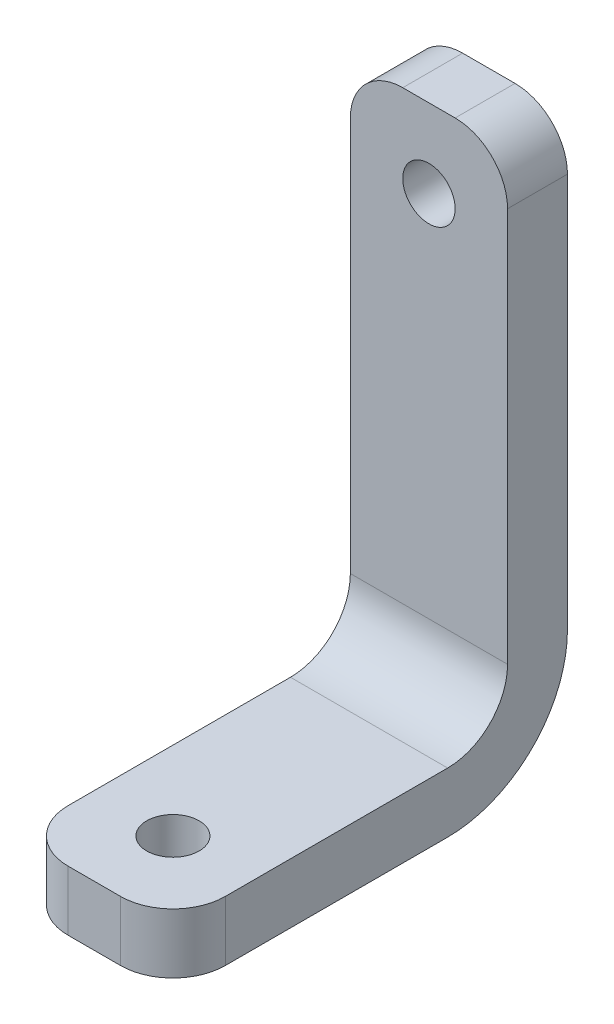
ISO-10303-21;
HEADER;
FILE_DESCRIPTION(('STEP AP214'),'2;1');
FILE_NAME('part.step','',(''),(''),'','','');
FILE_SCHEMA(('AUTOMOTIVE_DESIGN { 1 0 10303 214 1 1 1 1 }'));
ENDSEC;
DATA;
#1=APPLICATION_CONTEXT('core data for automotive mechanical design processes');
#2=APPLICATION_PROTOCOL_DEFINITION('international standard','automotive_design',2000,#1);
#3=PRODUCT_CONTEXT('',#1,'mechanical');
#4=PRODUCT('Part','Part','',(#3));
#5=PRODUCT_RELATED_PRODUCT_CATEGORY('part','',(#4));
#6=PRODUCT_DEFINITION_FORMATION('','',#4);
#7=PRODUCT_DEFINITION_CONTEXT('part definition',#1,'design');
#8=PRODUCT_DEFINITION('design','',#6,#7);
#9=PRODUCT_DEFINITION_SHAPE('','',#8);
#10=(LENGTH_UNIT() NAMED_UNIT(*) SI_UNIT(.MILLI.,.METRE.));
#11=(NAMED_UNIT(*) PLANE_ANGLE_UNIT() SI_UNIT($,.RADIAN.));
#12=(NAMED_UNIT(*) SI_UNIT($,.STERADIAN.) SOLID_ANGLE_UNIT());
#13=UNCERTAINTY_MEASURE_WITH_UNIT(LENGTH_MEASURE(1.E-05),#10,'distance_accuracy_value','');
#14=(GEOMETRIC_REPRESENTATION_CONTEXT(3) GLOBAL_UNCERTAINTY_ASSIGNED_CONTEXT((#13)) GLOBAL_UNIT_ASSIGNED_CONTEXT((#10,
#11,#12)) REPRESENTATION_CONTEXT('',''));
#15=CARTESIAN_POINT('',(0.,0.,0.));
#16=DIRECTION('',(0.,0.,1.));
#17=DIRECTION('',(1.,0.,0.));
#18=AXIS2_PLACEMENT_3D('',#15,#16,#17);
#19=CARTESIAN_POINT('',(0.,0.,4.));
#20=DIRECTION('',(0.,0.,1.));
#21=DIRECTION('',(1.,0.,0.));
#22=AXIS2_PLACEMENT_3D('',#19,#20,#21);
#23=PLANE('',#22);
#24=DIRECTION('',(0.,-1.,0.));
#25=VECTOR('',#24,1.);
#26=CARTESIAN_POINT('',(-5.24999999999999,18.925,4.));
#27=LINE('',#26,#25);
#28=CARTESIAN_POINT('',(-5.24999999999999,15.425,4.));
#29=VERTEX_POINT('',#28);
#30=CARTESIAN_POINT('',(-5.24999999999999,-10.925,4.));
#31=VERTEX_POINT('',#30);
#32=EDGE_CURVE('E188',#29,#31,#27,.T.);
#33=ORIENTED_EDGE('',*,*,#32,.T.);
#34=DIRECTION('',(-1.,0.,0.));
#35=VECTOR('',#34,1.);
#36=CARTESIAN_POINT('',(0.,-10.925,4.));
#37=LINE('',#36,#35);
#38=CARTESIAN_POINT('',(5.24999999999999,-10.925,4.));
#39=VERTEX_POINT('',#38);
#40=EDGE_CURVE('E260',#31,#39,#37,.F.);
#41=ORIENTED_EDGE('',*,*,#40,.T.);
#42=DIRECTION('',(0.,1.,0.));
#43=VECTOR('',#42,1.);
#44=CARTESIAN_POINT('',(5.24999999999999,18.925,4.));
#45=LINE('',#44,#43);
#46=CARTESIAN_POINT('',(5.24999999999999,15.425,4.));
#47=VERTEX_POINT('',#46);
#48=EDGE_CURVE('E192',#39,#47,#45,.T.);
#49=ORIENTED_EDGE('',*,*,#48,.T.);
#50=CARTESIAN_POINT('',(1.74999999999999,15.425,4.));
#51=DIRECTION('',(0.,0.,1.));
#52=DIRECTION('',(1.,0.,0.));
#53=AXIS2_PLACEMENT_3D('',#50,#51,#52);
#54=CIRCLE('',#53,3.5);
#55=CARTESIAN_POINT('',(1.74999999999999,18.925,4.));
#56=VERTEX_POINT('',#55);
#57=EDGE_CURVE('E250',#47,#56,#54,.T.);
#58=ORIENTED_EDGE('',*,*,#57,.T.);
#59=DIRECTION('',(-1.,0.,0.));
#60=VECTOR('',#59,1.);
#61=CARTESIAN_POINT('',(-5.24999999999999,18.925,4.));
#62=LINE('',#61,#60);
#63=CARTESIAN_POINT('',(-1.74999999999999,18.925,4.));
#64=VERTEX_POINT('',#63);
#65=EDGE_CURVE('E196',#56,#64,#62,.T.);
#66=ORIENTED_EDGE('',*,*,#65,.T.);
#67=CARTESIAN_POINT('',(-1.74999999999999,15.425,4.));
#68=DIRECTION('',(0.,0.,1.));
#69=DIRECTION('',(1.,0.,0.));
#70=AXIS2_PLACEMENT_3D('',#67,#68,#69);
#71=CIRCLE('',#70,3.5);
#72=EDGE_CURVE('E253',#64,#29,#71,.T.);
#73=ORIENTED_EDGE('',*,*,#72,.T.);
#74=EDGE_LOOP('',(#33,#41,#49,#58,#66,#73));
#75=FACE_BOUND('',#74,.T.);
#76=CARTESIAN_POINT('',(0.,13.675,4.));
#77=DIRECTION('',(0.,0.,1.));
#78=DIRECTION('',(1.,0.,0.));
#79=AXIS2_PLACEMENT_3D('',#76,#77,#78);
#80=CIRCLE('',#79,1.75);
#81=CARTESIAN_POINT('',(1.75,13.675,4.));
#82=VERTEX_POINT('',#81);
#83=EDGE_CURVE('E180',#82,#82,#80,.T.);
#84=ORIENTED_EDGE('',*,*,#83,.F.);
#85=EDGE_LOOP('',(#84));
#86=FACE_BOUND('',#85,.T.);
#87=ADVANCED_FACE('F42',(#75,#86),#23,.T.);
#88=CARTESIAN_POINT('',(0.,0.,0.));
#89=DIRECTION('',(0.,0.,1.));
#90=DIRECTION('',(1.,0.,0.));
#91=AXIS2_PLACEMENT_3D('',#88,#89,#90);
#92=PLANE('',#91);
#93=DIRECTION('',(0.,1.,0.));
#94=VECTOR('',#93,1.);
#95=CARTESIAN_POINT('',(5.24999999999999,18.925,0.));
#96=LINE('',#95,#94);
#97=CARTESIAN_POINT('',(5.24999999999999,-10.925,0.));
#98=VERTEX_POINT('',#97);
#99=CARTESIAN_POINT('',(5.24999999999999,15.425,0.));
#100=VERTEX_POINT('',#99);
#101=EDGE_CURVE('E203',#98,#100,#96,.T.);
#102=ORIENTED_EDGE('',*,*,#101,.F.);
#103=DIRECTION('',(1.,0.,0.));
#104=VECTOR('',#103,1.);
#105=CARTESIAN_POINT('',(0.,-10.925,0.));
#106=LINE('',#105,#104);
#107=CARTESIAN_POINT('',(-5.24999999999999,-10.925,0.));
#108=VERTEX_POINT('',#107);
#109=EDGE_CURVE('E51',#98,#108,#106,.F.);
#110=ORIENTED_EDGE('',*,*,#109,.T.);
#111=DIRECTION('',(0.,-1.,0.));
#112=VECTOR('',#111,1.);
#113=CARTESIAN_POINT('',(-5.24999999999999,18.925,0.));
#114=LINE('',#113,#112);
#115=CARTESIAN_POINT('',(-5.24999999999999,15.425,0.));
#116=VERTEX_POINT('',#115);
#117=EDGE_CURVE('E184',#116,#108,#114,.T.);
#118=ORIENTED_EDGE('',*,*,#117,.F.);
#119=CARTESIAN_POINT('',(-1.74999999999999,15.425,0.));
#120=DIRECTION('',(0.,0.,1.));
#121=DIRECTION('',(1.,0.,0.));
#122=AXIS2_PLACEMENT_3D('',#119,#120,#121);
#123=CIRCLE('',#122,3.5);
#124=CARTESIAN_POINT('',(-1.74999999999999,18.925,0.));
#125=VERTEX_POINT('',#124);
#126=EDGE_CURVE('E240',#116,#125,#123,.F.);
#127=ORIENTED_EDGE('',*,*,#126,.T.);
#128=DIRECTION('',(-1.,0.,0.));
#129=VECTOR('',#128,1.);
#130=CARTESIAN_POINT('',(-5.24999999999999,18.925,0.));
#131=LINE('',#130,#129);
#132=CARTESIAN_POINT('',(1.74999999999999,18.925,0.));
#133=VERTEX_POINT('',#132);
#134=EDGE_CURVE('E193',#133,#125,#131,.T.);
#135=ORIENTED_EDGE('',*,*,#134,.F.);
#136=CARTESIAN_POINT('',(1.74999999999999,15.425,0.));
#137=DIRECTION('',(0.,0.,1.));
#138=DIRECTION('',(1.,0.,0.));
#139=AXIS2_PLACEMENT_3D('',#136,#137,#138);
#140=CIRCLE('',#139,3.5);
#141=EDGE_CURVE('E236',#133,#100,#140,.F.);
#142=ORIENTED_EDGE('',*,*,#141,.T.);
#143=EDGE_LOOP('',(#102,#110,#118,#127,#135,#142));
#144=FACE_BOUND('',#143,.T.);
#145=CARTESIAN_POINT('',(0.,13.675,0.));
#146=DIRECTION('',(0.,0.,1.));
#147=DIRECTION('',(1.,0.,0.));
#148=AXIS2_PLACEMENT_3D('',#145,#146,#147);
#149=CIRCLE('',#148,1.75);
#150=CARTESIAN_POINT('',(1.75,13.675,0.));
#151=VERTEX_POINT('',#150);
#152=EDGE_CURVE('E179',#151,#151,#149,.T.);
#153=ORIENTED_EDGE('',*,*,#152,.T.);
#154=EDGE_LOOP('',(#153));
#155=FACE_BOUND('',#154,.T.);
#156=ADVANCED_FACE('F298',(#144,#155),#92,.F.);
#157=CARTESIAN_POINT('',(-5.24999999999999,18.925,4.));
#158=DIRECTION('',(1.,0.,0.));
#159=DIRECTION('',(0.,0.,-1.));
#160=AXIS2_PLACEMENT_3D('',#157,#158,#159);
#161=PLANE('',#160);
#162=ORIENTED_EDGE('',*,*,#117,.T.);
#163=CARTESIAN_POINT('',(-5.24999999999999,-10.925,8.));
#164=DIRECTION('',(1.,0.,0.));
#165=DIRECTION('',(0.,0.,-1.));
#166=AXIS2_PLACEMENT_3D('',#163,#164,#165);
#167=CIRCLE('',#166,8.);
#168=CARTESIAN_POINT('',(-5.24999999999999,-18.925,8.));
#169=VERTEX_POINT('',#168);
#170=EDGE_CURVE('E11',#108,#169,#167,.F.);
#171=ORIENTED_EDGE('',*,*,#170,.T.);
#172=DIRECTION('',(0.,0.,-1.));
#173=VECTOR('',#172,1.);
#174=CARTESIAN_POINT('',(-5.24999999999999,-18.925,4.));
#175=LINE('',#174,#173);
#176=CARTESIAN_POINT('',(-5.24999999999999,-18.925,22.85));
#177=VERTEX_POINT('',#176);
#178=EDGE_CURVE('E211',#177,#169,#175,.T.);
#179=ORIENTED_EDGE('',*,*,#178,.F.);
#180=DIRECTION('',(0.,-1.,0.));
#181=VECTOR('',#180,1.);
#182=CARTESIAN_POINT('',(-5.24999999999999,18.925,22.85));
#183=LINE('',#182,#181);
#184=CARTESIAN_POINT('',(-5.24999999999999,-14.925,22.85));
#185=VERTEX_POINT('',#184);
#186=EDGE_CURVE('E136',#177,#185,#183,.F.);
#187=ORIENTED_EDGE('',*,*,#186,.T.);
#188=DIRECTION('',(0.,0.,-1.));
#189=VECTOR('',#188,1.);
#190=CARTESIAN_POINT('',(-5.24999999999999,-14.925,26.35));
#191=LINE('',#190,#189);
#192=CARTESIAN_POINT('',(-5.24999999999999,-14.925,8.00000000000001));
#193=VERTEX_POINT('',#192);
#194=EDGE_CURVE('E165',#185,#193,#191,.T.);
#195=ORIENTED_EDGE('',*,*,#194,.T.);
#196=CARTESIAN_POINT('',(-5.24999999999999,-10.925,8.));
#197=DIRECTION('',(1.,0.,0.));
#198=DIRECTION('',(0.,0.,-1.));
#199=AXIS2_PLACEMENT_3D('',#196,#197,#198);
#200=CIRCLE('',#199,4.);
#201=EDGE_CURVE('E263',#193,#31,#200,.T.);
#202=ORIENTED_EDGE('',*,*,#201,.T.);
#203=ORIENTED_EDGE('',*,*,#32,.F.);
#204=DIRECTION('',(0.,0.,-1.));
#205=VECTOR('',#204,1.);
#206=CARTESIAN_POINT('',(-5.24999999999999,15.425,4.));
#207=LINE('',#206,#205);
#208=EDGE_CURVE('E142',#29,#116,#207,.T.);
#209=ORIENTED_EDGE('',*,*,#208,.T.);
#210=EDGE_LOOP('',(#162,#171,#179,#187,#195,#202,#203,#209));
#211=FACE_BOUND('',#210,.T.);
#212=ADVANCED_FACE('F288',(#211),#161,.F.);
#213=CARTESIAN_POINT('',(-5.24999999999999,-18.925,4.));
#214=DIRECTION('',(0.,1.,0.));
#215=DIRECTION('',(0.,0.,1.));
#216=AXIS2_PLACEMENT_3D('',#213,#214,#215);
#217=PLANE('',#216);
#218=CARTESIAN_POINT('',(0.,-18.925,21.1));
#219=DIRECTION('',(0.,-1.,0.));
#220=DIRECTION('',(0.,0.,-1.));
#221=AXIS2_PLACEMENT_3D('',#218,#219,#220);
#222=CIRCLE('',#221,1.75);
#223=CARTESIAN_POINT('',(0.,-18.925,19.35));
#224=VERTEX_POINT('',#223);
#225=EDGE_CURVE('E168',#224,#224,#222,.T.);
#226=ORIENTED_EDGE('',*,*,#225,.F.);
#227=EDGE_LOOP('',(#226));
#228=FACE_BOUND('',#227,.T.);
#229=ORIENTED_EDGE('',*,*,#178,.T.);
#230=DIRECTION('',(1.,0.,0.));
#231=VECTOR('',#230,1.);
#232=CARTESIAN_POINT('',(-5.24999999999999,-18.925,8.));
#233=LINE('',#232,#231);
#234=CARTESIAN_POINT('',(5.24999999999999,-18.925,8.));
#235=VERTEX_POINT('',#234);
#236=EDGE_CURVE('E269',#169,#235,#233,.T.);
#237=ORIENTED_EDGE('',*,*,#236,.T.);
#238=DIRECTION('',(0.,0.,-1.));
#239=VECTOR('',#238,1.);
#240=CARTESIAN_POINT('',(5.24999999999999,-18.925,4.));
#241=LINE('',#240,#239);
#242=CARTESIAN_POINT('',(5.24999999999999,-18.925,22.85));
#243=VERTEX_POINT('',#242);
#244=EDGE_CURVE('E200',#243,#235,#241,.T.);
#245=ORIENTED_EDGE('',*,*,#244,.F.);
#246=CARTESIAN_POINT('',(1.74999999999999,-18.925,22.85));
#247=DIRECTION('',(0.,1.,0.));
#248=DIRECTION('',(0.,0.,1.));
#249=AXIS2_PLACEMENT_3D('',#246,#247,#248);
#250=CIRCLE('',#249,3.5);
#251=CARTESIAN_POINT('',(1.74999999999999,-18.925,26.35));
#252=VERTEX_POINT('',#251);
#253=EDGE_CURVE('E143',#243,#252,#250,.F.);
#254=ORIENTED_EDGE('',*,*,#253,.T.);
#255=DIRECTION('',(1.,0.,0.));
#256=VECTOR('',#255,1.);
#257=CARTESIAN_POINT('',(-5.24999999999999,-18.925,26.35));
#258=LINE('',#257,#256);
#259=CARTESIAN_POINT('',(-1.74999999999999,-18.925,26.35));
#260=VERTEX_POINT('',#259);
#261=EDGE_CURVE('E150',#260,#252,#258,.T.);
#262=ORIENTED_EDGE('',*,*,#261,.F.);
#263=CARTESIAN_POINT('',(-1.74999999999999,-18.925,22.85));
#264=DIRECTION('',(0.,1.,0.));
#265=DIRECTION('',(0.,0.,1.));
#266=AXIS2_PLACEMENT_3D('',#263,#264,#265);
#267=CIRCLE('',#266,3.5);
#268=EDGE_CURVE('E131',#260,#177,#267,.F.);
#269=ORIENTED_EDGE('',*,*,#268,.T.);
#270=EDGE_LOOP('',(#229,#237,#245,#254,#262,#269));
#271=FACE_BOUND('',#270,.T.);
#272=ADVANCED_FACE('F157',(#228,#271),#217,.F.);
#273=CARTESIAN_POINT('',(5.24999999999999,18.925,4.));
#274=DIRECTION('',(-1.,0.,0.));
#275=DIRECTION('',(0.,0.,1.));
#276=AXIS2_PLACEMENT_3D('',#273,#274,#275);
#277=PLANE('',#276);
#278=ORIENTED_EDGE('',*,*,#244,.T.);
#279=CARTESIAN_POINT('',(5.24999999999999,-10.925,8.));
#280=DIRECTION('',(-1.,0.,0.));
#281=DIRECTION('',(0.,0.,1.));
#282=AXIS2_PLACEMENT_3D('',#279,#280,#281);
#283=CIRCLE('',#282,8.);
#284=EDGE_CURVE('E65',#235,#98,#283,.F.);
#285=ORIENTED_EDGE('',*,*,#284,.T.);
#286=ORIENTED_EDGE('',*,*,#101,.T.);
#287=DIRECTION('',(0.,0.,-1.));
#288=VECTOR('',#287,1.);
#289=CARTESIAN_POINT('',(5.24999999999999,15.425,4.));
#290=LINE('',#289,#288);
#291=EDGE_CURVE('E229',#100,#47,#290,.F.);
#292=ORIENTED_EDGE('',*,*,#291,.T.);
#293=ORIENTED_EDGE('',*,*,#48,.F.);
#294=CARTESIAN_POINT('',(5.24999999999999,-10.925,8.));
#295=DIRECTION('',(-1.,0.,0.));
#296=DIRECTION('',(0.,0.,1.));
#297=AXIS2_PLACEMENT_3D('',#294,#295,#296);
#298=CIRCLE('',#297,4.);
#299=CARTESIAN_POINT('',(5.24999999999999,-14.925,8.00000000000001));
#300=VERTEX_POINT('',#299);
#301=EDGE_CURVE('E266',#39,#300,#298,.T.);
#302=ORIENTED_EDGE('',*,*,#301,.T.);
#303=DIRECTION('',(0.,0.,-1.));
#304=VECTOR('',#303,1.);
#305=CARTESIAN_POINT('',(5.24999999999999,-14.925,26.35));
#306=LINE('',#305,#304);
#307=CARTESIAN_POINT('',(5.24999999999999,-14.925,22.85));
#308=VERTEX_POINT('',#307);
#309=EDGE_CURVE('E175',#308,#300,#306,.T.);
#310=ORIENTED_EDGE('',*,*,#309,.F.);
#311=DIRECTION('',(0.,1.,0.));
#312=VECTOR('',#311,1.);
#313=CARTESIAN_POINT('',(5.24999999999999,18.925,22.85));
#314=LINE('',#313,#312);
#315=EDGE_CURVE('E233',#308,#243,#314,.F.);
#316=ORIENTED_EDGE('',*,*,#315,.T.);
#317=EDGE_LOOP('',(#278,#285,#286,#292,#293,#302,#310,#316));
#318=FACE_BOUND('',#317,.T.);
#319=ADVANCED_FACE('F278',(#318),#277,.F.);
#320=CARTESIAN_POINT('',(-5.24999999999999,18.925,4.));
#321=DIRECTION('',(0.,-1.,0.));
#322=DIRECTION('',(0.,0.,-1.));
#323=AXIS2_PLACEMENT_3D('',#320,#321,#322);
#324=PLANE('',#323);
#325=ORIENTED_EDGE('',*,*,#134,.T.);
#326=DIRECTION('',(0.,0.,-1.));
#327=VECTOR('',#326,1.);
#328=CARTESIAN_POINT('',(-1.74999999999999,18.925,4.));
#329=LINE('',#328,#327);
#330=EDGE_CURVE('E247',#125,#64,#329,.F.);
#331=ORIENTED_EDGE('',*,*,#330,.T.);
#332=ORIENTED_EDGE('',*,*,#65,.F.);
#333=DIRECTION('',(0.,0.,-1.));
#334=VECTOR('',#333,1.);
#335=CARTESIAN_POINT('',(1.74999999999999,18.925,4.));
#336=LINE('',#335,#334);
#337=EDGE_CURVE('E243',#56,#133,#336,.T.);
#338=ORIENTED_EDGE('',*,*,#337,.T.);
#339=EDGE_LOOP('',(#325,#331,#332,#338));
#340=FACE_BOUND('',#339,.T.);
#341=ADVANCED_FACE('F310',(#340),#324,.F.);
#342=CARTESIAN_POINT('',(0.,13.675,4.));
#343=DIRECTION('',(0.,0.,-1.));
#344=DIRECTION('',(-1.,0.,0.));
#345=AXIS2_PLACEMENT_3D('',#342,#343,#344);
#346=CYLINDRICAL_SURFACE('',#345,1.75);
#347=ORIENTED_EDGE('',*,*,#83,.T.);
#348=EDGE_LOOP('',(#347));
#349=FACE_BOUND('',#348,.T.);
#350=ORIENTED_EDGE('',*,*,#152,.F.);
#351=EDGE_LOOP('',(#350));
#352=FACE_BOUND('',#351,.T.);
#353=ADVANCED_FACE('F307',(#349,#352),#346,.F.);
#354=CARTESIAN_POINT('',(-5.24999999999999,-14.925,26.35));
#355=DIRECTION('',(0.,-1.,0.));
#356=DIRECTION('',(0.,0.,-1.));
#357=AXIS2_PLACEMENT_3D('',#354,#355,#356);
#358=PLANE('',#357);
#359=CARTESIAN_POINT('',(0.,-14.925,21.1));
#360=DIRECTION('',(0.,-1.,0.));
#361=DIRECTION('',(0.,0.,-1.));
#362=AXIS2_PLACEMENT_3D('',#359,#360,#361);
#363=CIRCLE('',#362,1.75);
#364=CARTESIAN_POINT('',(0.,-14.925,19.35));
#365=VERTEX_POINT('',#364);
#366=EDGE_CURVE('E161',#365,#365,#363,.F.);
#367=ORIENTED_EDGE('',*,*,#366,.F.);
#368=EDGE_LOOP('',(#367));
#369=FACE_BOUND('',#368,.T.);
#370=ORIENTED_EDGE('',*,*,#309,.T.);
#371=DIRECTION('',(-1.,0.,0.));
#372=VECTOR('',#371,1.);
#373=CARTESIAN_POINT('',(-5.24999999999999,-14.925,8.));
#374=LINE('',#373,#372);
#375=EDGE_CURVE('E256',#300,#193,#374,.T.);
#376=ORIENTED_EDGE('',*,*,#375,.T.);
#377=ORIENTED_EDGE('',*,*,#194,.F.);
#378=CARTESIAN_POINT('',(-1.74999999999999,-14.925,22.85));
#379=DIRECTION('',(0.,-1.,0.));
#380=DIRECTION('',(0.,0.,-1.));
#381=AXIS2_PLACEMENT_3D('',#378,#379,#380);
#382=CIRCLE('',#381,3.5);
#383=CARTESIAN_POINT('',(-1.74999999999999,-14.925,26.35));
#384=VERTEX_POINT('',#383);
#385=EDGE_CURVE('E226',#185,#384,#382,.F.);
#386=ORIENTED_EDGE('',*,*,#385,.T.);
#387=DIRECTION('',(-1.,0.,0.));
#388=VECTOR('',#387,1.);
#389=CARTESIAN_POINT('',(-5.24999999999999,-14.925,26.35));
#390=LINE('',#389,#388);
#391=CARTESIAN_POINT('',(1.74999999999999,-14.925,26.35));
#392=VERTEX_POINT('',#391);
#393=EDGE_CURVE('E153',#392,#384,#390,.T.);
#394=ORIENTED_EDGE('',*,*,#393,.F.);
#395=CARTESIAN_POINT('',(1.74999999999999,-14.925,22.85));
#396=DIRECTION('',(0.,-1.,0.));
#397=DIRECTION('',(0.,0.,-1.));
#398=AXIS2_PLACEMENT_3D('',#395,#396,#397);
#399=CIRCLE('',#398,3.5);
#400=EDGE_CURVE('E223',#392,#308,#399,.F.);
#401=ORIENTED_EDGE('',*,*,#400,.T.);
#402=EDGE_LOOP('',(#370,#376,#377,#386,#394,#401));
#403=FACE_BOUND('',#402,.T.);
#404=ADVANCED_FACE('F284',(#369,#403),#358,.F.);
#405=CARTESIAN_POINT('',(0.,0.,26.35));
#406=DIRECTION('',(0.,0.,-1.));
#407=DIRECTION('',(-1.,0.,0.));
#408=AXIS2_PLACEMENT_3D('',#405,#406,#407);
#409=PLANE('',#408);
#410=ORIENTED_EDGE('',*,*,#393,.T.);
#411=DIRECTION('',(0.,-1.,0.));
#412=VECTOR('',#411,1.);
#413=CARTESIAN_POINT('',(-1.74999999999999,0.,26.35));
#414=LINE('',#413,#412);
#415=EDGE_CURVE('E135',#384,#260,#414,.T.);
#416=ORIENTED_EDGE('',*,*,#415,.T.);
#417=ORIENTED_EDGE('',*,*,#261,.T.);
#418=DIRECTION('',(0.,1.,0.));
#419=VECTOR('',#418,1.);
#420=CARTESIAN_POINT('',(1.74999999999999,0.,26.35));
#421=LINE('',#420,#419);
#422=EDGE_CURVE('E155',#252,#392,#421,.T.);
#423=ORIENTED_EDGE('',*,*,#422,.T.);
#424=EDGE_LOOP('',(#410,#416,#417,#423));
#425=FACE_BOUND('',#424,.T.);
#426=ADVANCED_FACE('F148',(#425),#409,.F.);
#427=CARTESIAN_POINT('',(0.,18.926,21.1));
#428=DIRECTION('',(0.,-1.,0.));
#429=DIRECTION('',(0.,0.,-1.));
#430=AXIS2_PLACEMENT_3D('',#427,#428,#429);
#431=CYLINDRICAL_SURFACE('',#430,1.75);
#432=ORIENTED_EDGE('',*,*,#225,.T.);
#433=EDGE_LOOP('',(#432));
#434=FACE_BOUND('',#433,.T.);
#435=ORIENTED_EDGE('',*,*,#366,.T.);
#436=EDGE_LOOP('',(#435));
#437=FACE_BOUND('',#436,.T.);
#438=ADVANCED_FACE('F323',(#434,#437),#431,.F.);
#439=CARTESIAN_POINT('',(-1.74999999999999,0.,22.85));
#440=DIRECTION('',(0.,-1.,0.));
#441=DIRECTION('',(0.,0.,-1.));
#442=AXIS2_PLACEMENT_3D('',#439,#440,#441);
#443=CYLINDRICAL_SURFACE('',#442,3.5);
#444=ORIENTED_EDGE('',*,*,#385,.F.);
#445=ORIENTED_EDGE('',*,*,#186,.F.);
#446=ORIENTED_EDGE('',*,*,#268,.F.);
#447=ORIENTED_EDGE('',*,*,#415,.F.);
#448=EDGE_LOOP('',(#444,#445,#446,#447));
#449=FACE_BOUND('',#448,.T.);
#450=ADVANCED_FACE('F134',(#449),#443,.T.);
#451=CARTESIAN_POINT('',(1.74999999999999,0.,22.85));
#452=DIRECTION('',(0.,1.,0.));
#453=DIRECTION('',(0.,0.,1.));
#454=AXIS2_PLACEMENT_3D('',#451,#452,#453);
#455=CYLINDRICAL_SURFACE('',#454,3.5);
#456=ORIENTED_EDGE('',*,*,#253,.F.);
#457=ORIENTED_EDGE('',*,*,#315,.F.);
#458=ORIENTED_EDGE('',*,*,#400,.F.);
#459=ORIENTED_EDGE('',*,*,#422,.F.);
#460=EDGE_LOOP('',(#456,#457,#458,#459));
#461=FACE_BOUND('',#460,.T.);
#462=ADVANCED_FACE('F282',(#461),#455,.T.);
#463=CARTESIAN_POINT('',(-1.74999999999999,15.425,4.));
#464=DIRECTION('',(0.,0.,-1.));
#465=DIRECTION('',(-1.,0.,0.));
#466=AXIS2_PLACEMENT_3D('',#463,#464,#465);
#467=CYLINDRICAL_SURFACE('',#466,3.5);
#468=ORIENTED_EDGE('',*,*,#72,.F.);
#469=ORIENTED_EDGE('',*,*,#330,.F.);
#470=ORIENTED_EDGE('',*,*,#126,.F.);
#471=ORIENTED_EDGE('',*,*,#208,.F.);
#472=EDGE_LOOP('',(#468,#469,#470,#471));
#473=FACE_BOUND('',#472,.T.);
#474=ADVANCED_FACE('F326',(#473),#467,.T.);
#475=CARTESIAN_POINT('',(1.74999999999999,15.425,4.));
#476=DIRECTION('',(0.,0.,-1.));
#477=DIRECTION('',(-1.,0.,0.));
#478=AXIS2_PLACEMENT_3D('',#475,#476,#477);
#479=CYLINDRICAL_SURFACE('',#478,3.5);
#480=ORIENTED_EDGE('',*,*,#57,.F.);
#481=ORIENTED_EDGE('',*,*,#291,.F.);
#482=ORIENTED_EDGE('',*,*,#141,.F.);
#483=ORIENTED_EDGE('',*,*,#337,.F.);
#484=EDGE_LOOP('',(#480,#481,#482,#483));
#485=FACE_BOUND('',#484,.T.);
#486=ADVANCED_FACE('F295',(#485),#479,.T.);
#487=CARTESIAN_POINT('',(-5.24999999999999,-10.925,8.));
#488=DIRECTION('',(-1.,0.,0.));
#489=DIRECTION('',(0.,0.,1.));
#490=AXIS2_PLACEMENT_3D('',#487,#488,#489);
#491=CYLINDRICAL_SURFACE('',#490,4.);
#492=ORIENTED_EDGE('',*,*,#301,.F.);
#493=ORIENTED_EDGE('',*,*,#40,.F.);
#494=ORIENTED_EDGE('',*,*,#201,.F.);
#495=ORIENTED_EDGE('',*,*,#375,.F.);
#496=EDGE_LOOP('',(#492,#493,#494,#495));
#497=FACE_BOUND('',#496,.T.);
#498=ADVANCED_FACE('F291',(#497),#491,.F.);
#499=CARTESIAN_POINT('',(-5.24999999999999,-10.925,8.));
#500=DIRECTION('',(1.,0.,0.));
#501=DIRECTION('',(0.,0.,-1.));
#502=AXIS2_PLACEMENT_3D('',#499,#500,#501);
#503=CYLINDRICAL_SURFACE('',#502,8.);
#504=ORIENTED_EDGE('',*,*,#170,.F.);
#505=ORIENTED_EDGE('',*,*,#109,.F.);
#506=ORIENTED_EDGE('',*,*,#284,.F.);
#507=ORIENTED_EDGE('',*,*,#236,.F.);
#508=EDGE_LOOP('',(#504,#505,#506,#507));
#509=FACE_BOUND('',#508,.T.);
#510=ADVANCED_FACE('F44',(#509),#503,.T.);
#511=CLOSED_SHELL('',(#87,#156,#212,#272,#319,#341,#353,#404,#426,#438,#450,#462,#474,#486,#498,#510));
#512=MANIFOLD_SOLID_BREP('B2',#511);
#513=ADVANCED_BREP_SHAPE_REPRESENTATION('',(#18,#512),#14);
#514=SHAPE_DEFINITION_REPRESENTATION(#9,#513);
ENDSEC;
END-ISO-10303-21;
